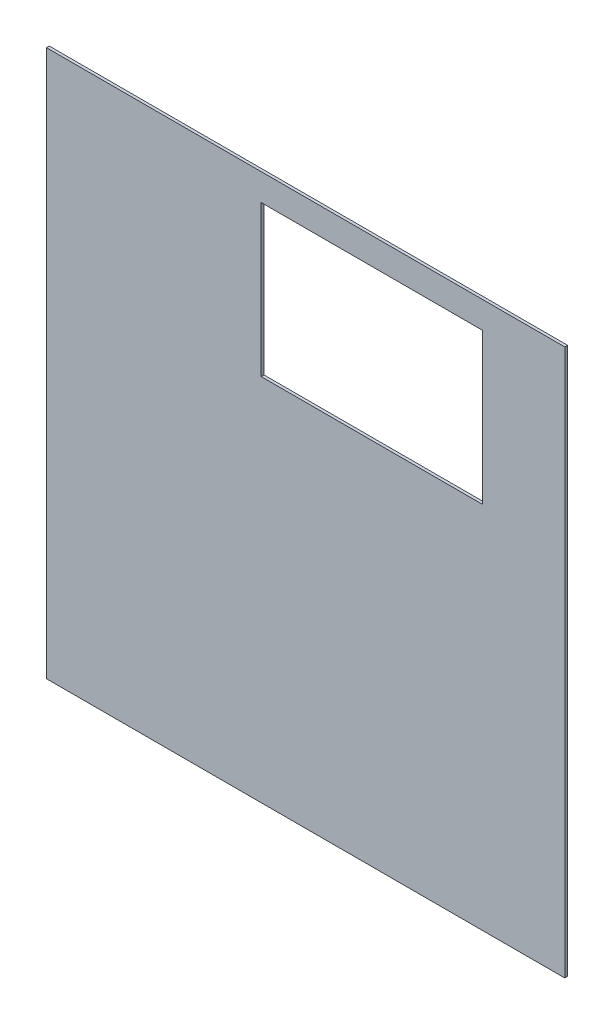
ISO-10303-21;
HEADER;
FILE_DESCRIPTION(('STEP AP214'),'2;1');
FILE_NAME('part.step','',(''),(''),'','','');
FILE_SCHEMA(('AUTOMOTIVE_DESIGN { 1 0 10303 214 1 1 1 1 }'));
ENDSEC;
DATA;
#1=APPLICATION_CONTEXT('core data for automotive mechanical design processes');
#2=APPLICATION_PROTOCOL_DEFINITION('international standard','automotive_design',2000,#1);
#3=PRODUCT_CONTEXT('',#1,'mechanical');
#4=PRODUCT('Part','Part','',(#3));
#5=PRODUCT_RELATED_PRODUCT_CATEGORY('part','',(#4));
#6=PRODUCT_DEFINITION_FORMATION('','',#4);
#7=PRODUCT_DEFINITION_CONTEXT('part definition',#1,'design');
#8=PRODUCT_DEFINITION('design','',#6,#7);
#9=PRODUCT_DEFINITION_SHAPE('','',#8);
#10=(LENGTH_UNIT() NAMED_UNIT(*) SI_UNIT(.MILLI.,.METRE.));
#11=(NAMED_UNIT(*) PLANE_ANGLE_UNIT() SI_UNIT($,.RADIAN.));
#12=(NAMED_UNIT(*) SI_UNIT($,.STERADIAN.) SOLID_ANGLE_UNIT());
#13=UNCERTAINTY_MEASURE_WITH_UNIT(LENGTH_MEASURE(1.E-05),#10,'distance_accuracy_value','');
#14=(GEOMETRIC_REPRESENTATION_CONTEXT(3) GLOBAL_UNCERTAINTY_ASSIGNED_CONTEXT((#13)) GLOBAL_UNIT_ASSIGNED_CONTEXT((#10,
#11,#12)) REPRESENTATION_CONTEXT('',''));
#15=CARTESIAN_POINT('',(0.,0.,0.));
#16=DIRECTION('',(0.,0.,1.));
#17=DIRECTION('',(1.,0.,0.));
#18=AXIS2_PLACEMENT_3D('',#15,#16,#17);
#19=CARTESIAN_POINT('',(184.,194.,0.));
#20=DIRECTION('',(0.,0.,1.));
#21=DIRECTION('',(1.,0.,0.));
#22=AXIS2_PLACEMENT_3D('',#19,#20,#21);
#23=PLANE('',#22);
#24=DIRECTION('',(1.,0.,0.));
#25=VECTOR('',#24,1.);
#26=CARTESIAN_POINT('',(309.5,262.,0.));
#27=LINE('',#26,#25);
#28=CARTESIAN_POINT('',(152.5,262.,0.));
#29=VERTEX_POINT('',#28);
#30=CARTESIAN_POINT('',(309.5,262.,0.));
#31=VERTEX_POINT('',#30);
#32=EDGE_CURVE('E124',#29,#31,#27,.T.);
#33=ORIENTED_EDGE('',*,*,#32,.T.);
#34=DIRECTION('',(0.,1.,0.));
#35=VECTOR('',#34,1.);
#36=CARTESIAN_POINT('',(309.5,369.,0.));
#37=LINE('',#36,#35);
#38=CARTESIAN_POINT('',(309.5,369.,0.));
#39=VERTEX_POINT('',#38);
#40=EDGE_CURVE('E117',#31,#39,#37,.T.);
#41=ORIENTED_EDGE('',*,*,#40,.T.);
#42=DIRECTION('',(1.,0.,0.));
#43=VECTOR('',#42,1.);
#44=CARTESIAN_POINT('',(152.5,369.,0.));
#45=LINE('',#44,#43);
#46=CARTESIAN_POINT('',(152.5,369.,0.));
#47=VERTEX_POINT('',#46);
#48=EDGE_CURVE('E112',#39,#47,#45,.F.);
#49=ORIENTED_EDGE('',*,*,#48,.T.);
#50=DIRECTION('',(0.,1.,0.));
#51=VECTOR('',#50,1.);
#52=CARTESIAN_POINT('',(152.5,262.,0.));
#53=LINE('',#52,#51);
#54=EDGE_CURVE('E108',#47,#29,#53,.F.);
#55=ORIENTED_EDGE('',*,*,#54,.T.);
#56=EDGE_LOOP('',(#33,#41,#49,#55));
#57=FACE_BOUND('',#56,.T.);
#58=DIRECTION('',(0.,1.,0.));
#59=VECTOR('',#58,1.);
#60=CARTESIAN_POINT('',(0.,388.,0.));
#61=LINE('',#60,#59);
#62=CARTESIAN_POINT('',(0.,388.,0.));
#63=VERTEX_POINT('',#62);
#64=CARTESIAN_POINT('',(0.,0.,0.));
#65=VERTEX_POINT('',#64);
#66=EDGE_CURVE('E102',#63,#65,#61,.F.);
#67=ORIENTED_EDGE('',*,*,#66,.F.);
#68=DIRECTION('',(1.,0.,0.));
#69=VECTOR('',#68,1.);
#70=CARTESIAN_POINT('',(368.,388.,0.));
#71=LINE('',#70,#69);
#72=CARTESIAN_POINT('',(368.,388.,0.));
#73=VERTEX_POINT('',#72);
#74=EDGE_CURVE('E78',#73,#63,#71,.F.);
#75=ORIENTED_EDGE('',*,*,#74,.F.);
#76=DIRECTION('',(0.,1.,0.));
#77=VECTOR('',#76,1.);
#78=CARTESIAN_POINT('',(368.,0.,0.));
#79=LINE('',#78,#77);
#80=CARTESIAN_POINT('',(368.,0.,0.));
#81=VERTEX_POINT('',#80);
#82=EDGE_CURVE('E80',#81,#73,#79,.T.);
#83=ORIENTED_EDGE('',*,*,#82,.F.);
#84=DIRECTION('',(1.,0.,0.));
#85=VECTOR('',#84,1.);
#86=CARTESIAN_POINT('',(0.,0.,0.));
#87=LINE('',#86,#85);
#88=EDGE_CURVE('E19',#65,#81,#87,.T.);
#89=ORIENTED_EDGE('',*,*,#88,.F.);
#90=EDGE_LOOP('',(#67,#75,#83,#89));
#91=FACE_BOUND('',#90,.T.);
#92=ADVANCED_FACE('F16',(#57,#91),#23,.F.);
#93=CARTESIAN_POINT('',(0.,0.,0.));
#94=DIRECTION('',(0.,-1.,0.));
#95=DIRECTION('',(0.,0.,-1.));
#96=AXIS2_PLACEMENT_3D('',#93,#94,#95);
#97=PLANE('',#96);
#98=DIRECTION('',(1.,0.,0.));
#99=VECTOR('',#98,1.);
#100=CARTESIAN_POINT('',(184.,0.,2.));
#101=LINE('',#100,#99);
#102=CARTESIAN_POINT('',(0.,0.,2.));
#103=VERTEX_POINT('',#102);
#104=CARTESIAN_POINT('',(368.,0.,2.));
#105=VERTEX_POINT('',#104);
#106=EDGE_CURVE('E127',#103,#105,#101,.T.);
#107=ORIENTED_EDGE('',*,*,#106,.F.);
#108=DIRECTION('',(0.,0.,1.));
#109=VECTOR('',#108,1.);
#110=CARTESIAN_POINT('',(0.,0.,0.));
#111=LINE('',#110,#109);
#112=EDGE_CURVE('E91',#65,#103,#111,.T.);
#113=ORIENTED_EDGE('',*,*,#112,.F.);
#114=ORIENTED_EDGE('',*,*,#88,.T.);
#115=DIRECTION('',(0.,0.,-1.));
#116=VECTOR('',#115,1.);
#117=CARTESIAN_POINT('',(368.,0.,0.));
#118=LINE('',#117,#116);
#119=EDGE_CURVE('E86',#105,#81,#118,.T.);
#120=ORIENTED_EDGE('',*,*,#119,.F.);
#121=EDGE_LOOP('',(#107,#113,#114,#120));
#122=FACE_BOUND('',#121,.T.);
#123=ADVANCED_FACE('F88',(#122),#97,.T.);
#124=CARTESIAN_POINT('',(368.,0.,0.));
#125=DIRECTION('',(1.,0.,0.));
#126=DIRECTION('',(0.,0.,-1.));
#127=AXIS2_PLACEMENT_3D('',#124,#125,#126);
#128=PLANE('',#127);
#129=DIRECTION('',(0.,1.,0.));
#130=VECTOR('',#129,1.);
#131=CARTESIAN_POINT('',(368.,194.,2.));
#132=LINE('',#131,#130);
#133=CARTESIAN_POINT('',(368.,388.,2.));
#134=VERTEX_POINT('',#133);
#135=EDGE_CURVE('E95',#105,#134,#132,.T.);
#136=ORIENTED_EDGE('',*,*,#135,.F.);
#137=ORIENTED_EDGE('',*,*,#119,.T.);
#138=ORIENTED_EDGE('',*,*,#82,.T.);
#139=DIRECTION('',(0.,0.,1.));
#140=VECTOR('',#139,1.);
#141=CARTESIAN_POINT('',(368.,388.,0.));
#142=LINE('',#141,#140);
#143=EDGE_CURVE('E98',#134,#73,#142,.F.);
#144=ORIENTED_EDGE('',*,*,#143,.F.);
#145=EDGE_LOOP('',(#136,#137,#138,#144));
#146=FACE_BOUND('',#145,.T.);
#147=ADVANCED_FACE('F93',(#146),#128,.T.);
#148=CARTESIAN_POINT('',(368.,388.,0.));
#149=DIRECTION('',(0.,1.,0.));
#150=DIRECTION('',(0.,0.,1.));
#151=AXIS2_PLACEMENT_3D('',#148,#149,#150);
#152=PLANE('',#151);
#153=DIRECTION('',(1.,0.,0.));
#154=VECTOR('',#153,1.);
#155=CARTESIAN_POINT('',(184.,388.,2.));
#156=LINE('',#155,#154);
#157=CARTESIAN_POINT('',(0.,388.,2.));
#158=VERTEX_POINT('',#157);
#159=EDGE_CURVE('E130',#134,#158,#156,.F.);
#160=ORIENTED_EDGE('',*,*,#159,.F.);
#161=ORIENTED_EDGE('',*,*,#143,.T.);
#162=ORIENTED_EDGE('',*,*,#74,.T.);
#163=DIRECTION('',(0.,0.,1.));
#164=VECTOR('',#163,1.);
#165=CARTESIAN_POINT('',(0.,388.,0.));
#166=LINE('',#165,#164);
#167=EDGE_CURVE('E105',#158,#63,#166,.F.);
#168=ORIENTED_EDGE('',*,*,#167,.F.);
#169=EDGE_LOOP('',(#160,#161,#162,#168));
#170=FACE_BOUND('',#169,.T.);
#171=ADVANCED_FACE('F168',(#170),#152,.T.);
#172=CARTESIAN_POINT('',(0.,388.,0.));
#173=DIRECTION('',(-1.,0.,0.));
#174=DIRECTION('',(0.,0.,1.));
#175=AXIS2_PLACEMENT_3D('',#172,#173,#174);
#176=PLANE('',#175);
#177=DIRECTION('',(0.,1.,0.));
#178=VECTOR('',#177,1.);
#179=CARTESIAN_POINT('',(0.,194.,2.));
#180=LINE('',#179,#178);
#181=EDGE_CURVE('E133',#158,#103,#180,.F.);
#182=ORIENTED_EDGE('',*,*,#181,.F.);
#183=ORIENTED_EDGE('',*,*,#167,.T.);
#184=ORIENTED_EDGE('',*,*,#66,.T.);
#185=ORIENTED_EDGE('',*,*,#112,.T.);
#186=EDGE_LOOP('',(#182,#183,#184,#185));
#187=FACE_BOUND('',#186,.T.);
#188=ADVANCED_FACE('F160',(#187),#176,.T.);
#189=CARTESIAN_POINT('',(152.5,262.,2.));
#190=DIRECTION('',(-1.,0.,0.));
#191=DIRECTION('',(0.,0.,1.));
#192=AXIS2_PLACEMENT_3D('',#189,#190,#191);
#193=PLANE('',#192);
#194=DIRECTION('',(0.,0.,1.));
#195=VECTOR('',#194,1.);
#196=CARTESIAN_POINT('',(152.5,369.,2.));
#197=LINE('',#196,#195);
#198=CARTESIAN_POINT('',(152.5,369.,2.));
#199=VERTEX_POINT('',#198);
#200=EDGE_CURVE('E110',#47,#199,#197,.T.);
#201=ORIENTED_EDGE('',*,*,#200,.T.);
#202=DIRECTION('',(0.,1.,0.));
#203=VECTOR('',#202,1.);
#204=CARTESIAN_POINT('',(152.5,194.,2.));
#205=LINE('',#204,#203);
#206=CARTESIAN_POINT('',(152.5,262.,2.));
#207=VERTEX_POINT('',#206);
#208=EDGE_CURVE('E136',#207,#199,#205,.T.);
#209=ORIENTED_EDGE('',*,*,#208,.F.);
#210=DIRECTION('',(0.,0.,1.));
#211=VECTOR('',#210,1.);
#212=CARTESIAN_POINT('',(152.5,262.,2.));
#213=LINE('',#212,#211);
#214=EDGE_CURVE('E121',#207,#29,#213,.F.);
#215=ORIENTED_EDGE('',*,*,#214,.T.);
#216=ORIENTED_EDGE('',*,*,#54,.F.);
#217=EDGE_LOOP('',(#201,#209,#215,#216));
#218=FACE_BOUND('',#217,.T.);
#219=ADVANCED_FACE('F158',(#218),#193,.F.);
#220=CARTESIAN_POINT('',(152.5,369.,2.));
#221=DIRECTION('',(0.,1.,0.));
#222=DIRECTION('',(0.,0.,1.));
#223=AXIS2_PLACEMENT_3D('',#220,#221,#222);
#224=PLANE('',#223);
#225=DIRECTION('',(0.,0.,1.));
#226=VECTOR('',#225,1.);
#227=CARTESIAN_POINT('',(309.5,369.,2.));
#228=LINE('',#227,#226);
#229=CARTESIAN_POINT('',(309.5,369.,2.));
#230=VERTEX_POINT('',#229);
#231=EDGE_CURVE('E115',#39,#230,#228,.T.);
#232=ORIENTED_EDGE('',*,*,#231,.T.);
#233=DIRECTION('',(1.,0.,0.));
#234=VECTOR('',#233,1.);
#235=CARTESIAN_POINT('',(184.,369.,2.));
#236=LINE('',#235,#234);
#237=EDGE_CURVE('E139',#199,#230,#236,.T.);
#238=ORIENTED_EDGE('',*,*,#237,.F.);
#239=ORIENTED_EDGE('',*,*,#200,.F.);
#240=ORIENTED_EDGE('',*,*,#48,.F.);
#241=EDGE_LOOP('',(#232,#238,#239,#240));
#242=FACE_BOUND('',#241,.T.);
#243=ADVANCED_FACE('F150',(#242),#224,.F.);
#244=CARTESIAN_POINT('',(309.5,369.,2.));
#245=DIRECTION('',(1.,0.,0.));
#246=DIRECTION('',(0.,1.,0.));
#247=AXIS2_PLACEMENT_3D('',#244,#245,#246);
#248=PLANE('',#247);
#249=DIRECTION('',(0.,0.,1.));
#250=VECTOR('',#249,1.);
#251=CARTESIAN_POINT('',(309.5,262.,2.));
#252=LINE('',#251,#250);
#253=CARTESIAN_POINT('',(309.5,262.,2.));
#254=VERTEX_POINT('',#253);
#255=EDGE_CURVE('E34',#31,#254,#252,.T.);
#256=ORIENTED_EDGE('',*,*,#255,.T.);
#257=DIRECTION('',(0.,1.,0.));
#258=VECTOR('',#257,1.);
#259=CARTESIAN_POINT('',(309.5,194.,2.));
#260=LINE('',#259,#258);
#261=EDGE_CURVE('E25',#230,#254,#260,.F.);
#262=ORIENTED_EDGE('',*,*,#261,.F.);
#263=ORIENTED_EDGE('',*,*,#231,.F.);
#264=ORIENTED_EDGE('',*,*,#40,.F.);
#265=EDGE_LOOP('',(#256,#262,#263,#264));
#266=FACE_BOUND('',#265,.T.);
#267=ADVANCED_FACE('F148',(#266),#248,.F.);
#268=CARTESIAN_POINT('',(309.5,262.,2.));
#269=DIRECTION('',(0.,-1.,0.));
#270=DIRECTION('',(1.,0.,0.));
#271=AXIS2_PLACEMENT_3D('',#268,#269,#270);
#272=PLANE('',#271);
#273=ORIENTED_EDGE('',*,*,#214,.F.);
#274=DIRECTION('',(1.,0.,0.));
#275=VECTOR('',#274,1.);
#276=CARTESIAN_POINT('',(184.,262.,2.));
#277=LINE('',#276,#275);
#278=EDGE_CURVE('E11',#254,#207,#277,.F.);
#279=ORIENTED_EDGE('',*,*,#278,.F.);
#280=ORIENTED_EDGE('',*,*,#255,.F.);
#281=ORIENTED_EDGE('',*,*,#32,.F.);
#282=EDGE_LOOP('',(#273,#279,#280,#281));
#283=FACE_BOUND('',#282,.T.);
#284=ADVANCED_FACE('F156',(#283),#272,.F.);
#285=CARTESIAN_POINT('',(184.,194.,2.));
#286=DIRECTION('',(0.,0.,1.));
#287=DIRECTION('',(1.,0.,0.));
#288=AXIS2_PLACEMENT_3D('',#285,#286,#287);
#289=PLANE('',#288);
#290=ORIENTED_EDGE('',*,*,#261,.T.);
#291=ORIENTED_EDGE('',*,*,#278,.T.);
#292=ORIENTED_EDGE('',*,*,#208,.T.);
#293=ORIENTED_EDGE('',*,*,#237,.T.);
#294=EDGE_LOOP('',(#290,#291,#292,#293));
#295=FACE_BOUND('',#294,.T.);
#296=ORIENTED_EDGE('',*,*,#159,.T.);
#297=ORIENTED_EDGE('',*,*,#181,.T.);
#298=ORIENTED_EDGE('',*,*,#106,.T.);
#299=ORIENTED_EDGE('',*,*,#135,.T.);
#300=EDGE_LOOP('',(#296,#297,#298,#299));
#301=FACE_BOUND('',#300,.T.);
#302=ADVANCED_FACE('F144',(#295,#301),#289,.T.);
#303=CLOSED_SHELL('',(#92,#123,#147,#171,#188,#219,#243,#267,#284,#302));
#304=MANIFOLD_SOLID_BREP('B1',#303);
#305=ADVANCED_BREP_SHAPE_REPRESENTATION('',(#18,#304),#14);
#306=SHAPE_DEFINITION_REPRESENTATION(#9,#305);
ENDSEC;
END-ISO-10303-21;
